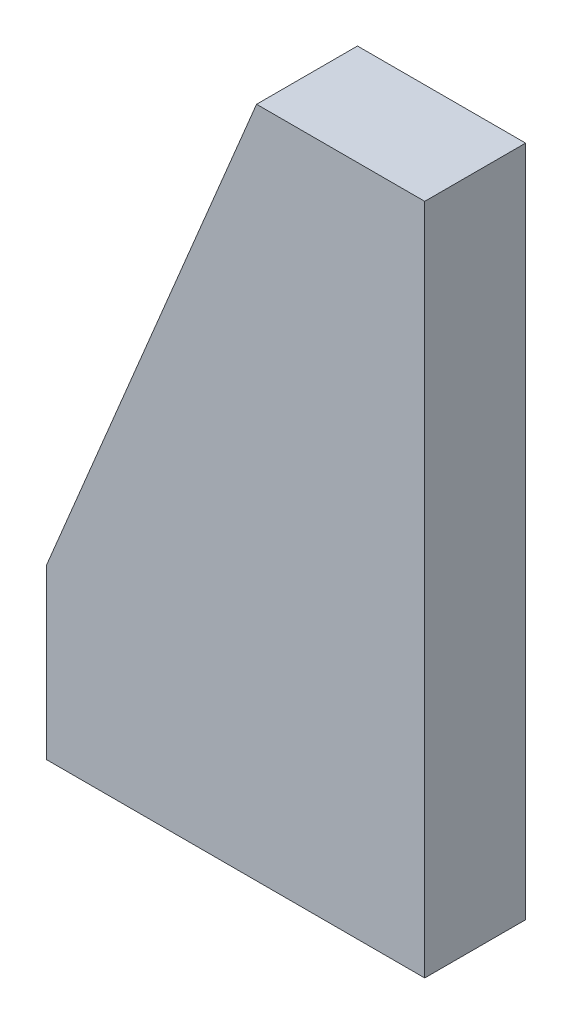
ISO-10303-21;
HEADER;
FILE_DESCRIPTION(('STEP AP214'),'2;1');
FILE_NAME('part.step','',(''),(''),'','','');
FILE_SCHEMA(('AUTOMOTIVE_DESIGN { 1 0 10303 214 1 1 1 1 }'));
ENDSEC;
DATA;
#1=APPLICATION_CONTEXT('core data for automotive mechanical design processes');
#2=APPLICATION_PROTOCOL_DEFINITION('international standard','automotive_design',2000,#1);
#3=PRODUCT_CONTEXT('',#1,'mechanical');
#4=PRODUCT('Part','Part','',(#3));
#5=PRODUCT_RELATED_PRODUCT_CATEGORY('part','',(#4));
#6=PRODUCT_DEFINITION_FORMATION('','',#4);
#7=PRODUCT_DEFINITION_CONTEXT('part definition',#1,'design');
#8=PRODUCT_DEFINITION('design','',#6,#7);
#9=PRODUCT_DEFINITION_SHAPE('','',#8);
#10=(LENGTH_UNIT() NAMED_UNIT(*) SI_UNIT(.MILLI.,.METRE.));
#11=(NAMED_UNIT(*) PLANE_ANGLE_UNIT() SI_UNIT($,.RADIAN.));
#12=(NAMED_UNIT(*) SI_UNIT($,.STERADIAN.) SOLID_ANGLE_UNIT());
#13=UNCERTAINTY_MEASURE_WITH_UNIT(LENGTH_MEASURE(1.E-05),#10,'distance_accuracy_value','');
#14=(GEOMETRIC_REPRESENTATION_CONTEXT(3) GLOBAL_UNCERTAINTY_ASSIGNED_CONTEXT((#13)) GLOBAL_UNIT_ASSIGNED_CONTEXT((#10,
#11,#12)) REPRESENTATION_CONTEXT('',''));
#15=CARTESIAN_POINT('',(0.,0.,0.));
#16=DIRECTION('',(0.,0.,1.));
#17=DIRECTION('',(1.,0.,0.));
#18=AXIS2_PLACEMENT_3D('',#15,#16,#17);
#19=CARTESIAN_POINT('',(0.,20.,12.));
#20=DIRECTION('',(1.,0.,0.));
#21=DIRECTION('',(0.,1.,0.));
#22=AXIS2_PLACEMENT_3D('',#19,#20,#21);
#23=PLANE('',#22);
#24=DIRECTION('',(0.,-1.,0.));
#25=VECTOR('',#24,1.);
#26=CARTESIAN_POINT('',(0.,20.,0.));
#27=LINE('',#26,#25);
#28=CARTESIAN_POINT('',(0.,20.,0.));
#29=VERTEX_POINT('',#28);
#30=CARTESIAN_POINT('',(0.,0.,0.));
#31=VERTEX_POINT('',#30);
#32=EDGE_CURVE('E108',#29,#31,#27,.T.);
#33=ORIENTED_EDGE('',*,*,#32,.T.);
#34=DIRECTION('',(0.,0.,-1.));
#35=VECTOR('',#34,1.);
#36=CARTESIAN_POINT('',(0.,0.,12.));
#37=LINE('',#36,#35);
#38=CARTESIAN_POINT('',(0.,0.,12.));
#39=VERTEX_POINT('',#38);
#40=EDGE_CURVE('E11',#39,#31,#37,.T.);
#41=ORIENTED_EDGE('',*,*,#40,.F.);
#42=DIRECTION('',(0.,-1.,0.));
#43=VECTOR('',#42,1.);
#44=CARTESIAN_POINT('',(0.,20.,12.));
#45=LINE('',#44,#43);
#46=CARTESIAN_POINT('',(0.,20.,12.));
#47=VERTEX_POINT('',#46);
#48=EDGE_CURVE('E116',#47,#39,#45,.T.);
#49=ORIENTED_EDGE('',*,*,#48,.F.);
#50=DIRECTION('',(0.,0.,-1.));
#51=VECTOR('',#50,1.);
#52=CARTESIAN_POINT('',(0.,20.,12.));
#53=LINE('',#52,#51);
#54=EDGE_CURVE('E104',#47,#29,#53,.T.);
#55=ORIENTED_EDGE('',*,*,#54,.T.);
#56=EDGE_LOOP('',(#33,#41,#49,#55));
#57=FACE_BOUND('',#56,.T.);
#58=ADVANCED_FACE('F34',(#57),#23,.F.);
#59=CARTESIAN_POINT('',(0.,0.,12.));
#60=DIRECTION('',(0.,1.,0.));
#61=DIRECTION('',(0.,0.,1.));
#62=AXIS2_PLACEMENT_3D('',#59,#60,#61);
#63=PLANE('',#62);
#64=DIRECTION('',(1.,0.,0.));
#65=VECTOR('',#64,1.);
#66=CARTESIAN_POINT('',(0.,0.,0.));
#67=LINE('',#66,#65);
#68=CARTESIAN_POINT('',(45.,0.,0.));
#69=VERTEX_POINT('',#68);
#70=EDGE_CURVE('E111',#31,#69,#67,.T.);
#71=ORIENTED_EDGE('',*,*,#70,.T.);
#72=DIRECTION('',(0.,0.,-1.));
#73=VECTOR('',#72,1.);
#74=CARTESIAN_POINT('',(45.,0.,12.));
#75=LINE('',#74,#73);
#76=CARTESIAN_POINT('',(45.,0.,12.));
#77=VERTEX_POINT('',#76);
#78=EDGE_CURVE('E42',#77,#69,#75,.T.);
#79=ORIENTED_EDGE('',*,*,#78,.F.);
#80=DIRECTION('',(1.,0.,0.));
#81=VECTOR('',#80,1.);
#82=CARTESIAN_POINT('',(0.,0.,12.));
#83=LINE('',#82,#81);
#84=EDGE_CURVE('E84',#39,#77,#83,.T.);
#85=ORIENTED_EDGE('',*,*,#84,.F.);
#86=ORIENTED_EDGE('',*,*,#40,.T.);
#87=EDGE_LOOP('',(#71,#79,#85,#86));
#88=FACE_BOUND('',#87,.T.);
#89=ADVANCED_FACE('F135',(#88),#63,.F.);
#90=CARTESIAN_POINT('',(45.,0.,12.));
#91=DIRECTION('',(-1.,0.,0.));
#92=DIRECTION('',(0.,0.,1.));
#93=AXIS2_PLACEMENT_3D('',#90,#91,#92);
#94=PLANE('',#93);
#95=DIRECTION('',(0.,1.,0.));
#96=VECTOR('',#95,1.);
#97=CARTESIAN_POINT('',(45.,0.,0.));
#98=LINE('',#97,#96);
#99=CARTESIAN_POINT('',(45.,80.,0.));
#100=VERTEX_POINT('',#99);
#101=EDGE_CURVE('E99',#69,#100,#98,.T.);
#102=ORIENTED_EDGE('',*,*,#101,.T.);
#103=DIRECTION('',(0.,0.,-1.));
#104=VECTOR('',#103,1.);
#105=CARTESIAN_POINT('',(45.,80.,12.));
#106=LINE('',#105,#104);
#107=CARTESIAN_POINT('',(45.,80.,12.));
#108=VERTEX_POINT('',#107);
#109=EDGE_CURVE('E96',#108,#100,#106,.T.);
#110=ORIENTED_EDGE('',*,*,#109,.F.);
#111=DIRECTION('',(0.,1.,0.));
#112=VECTOR('',#111,1.);
#113=CARTESIAN_POINT('',(45.,0.,12.));
#114=LINE('',#113,#112);
#115=EDGE_CURVE('E88',#77,#108,#114,.T.);
#116=ORIENTED_EDGE('',*,*,#115,.F.);
#117=ORIENTED_EDGE('',*,*,#78,.T.);
#118=EDGE_LOOP('',(#102,#110,#116,#117));
#119=FACE_BOUND('',#118,.T.);
#120=ADVANCED_FACE('F97',(#119),#94,.F.);
#121=CARTESIAN_POINT('',(45.,80.,12.));
#122=DIRECTION('',(0.,-1.,0.));
#123=DIRECTION('',(0.,0.,-1.));
#124=AXIS2_PLACEMENT_3D('',#121,#122,#123);
#125=PLANE('',#124);
#126=DIRECTION('',(-1.,0.,0.));
#127=VECTOR('',#126,1.);
#128=CARTESIAN_POINT('',(45.,80.,0.));
#129=LINE('',#128,#127);
#130=CARTESIAN_POINT('',(25.,80.,0.));
#131=VERTEX_POINT('',#130);
#132=EDGE_CURVE('E70',#100,#131,#129,.T.);
#133=ORIENTED_EDGE('',*,*,#132,.T.);
#134=DIRECTION('',(0.,0.,-1.));
#135=VECTOR('',#134,1.);
#136=CARTESIAN_POINT('',(25.,80.,12.));
#137=LINE('',#136,#135);
#138=CARTESIAN_POINT('',(25.,80.,12.));
#139=VERTEX_POINT('',#138);
#140=EDGE_CURVE('E100',#139,#131,#137,.T.);
#141=ORIENTED_EDGE('',*,*,#140,.F.);
#142=DIRECTION('',(-1.,0.,0.));
#143=VECTOR('',#142,1.);
#144=CARTESIAN_POINT('',(45.,80.,12.));
#145=LINE('',#144,#143);
#146=EDGE_CURVE('E92',#108,#139,#145,.T.);
#147=ORIENTED_EDGE('',*,*,#146,.F.);
#148=ORIENTED_EDGE('',*,*,#109,.T.);
#149=EDGE_LOOP('',(#133,#141,#147,#148));
#150=FACE_BOUND('',#149,.T.);
#151=ADVANCED_FACE('F102',(#150),#125,.F.);
#152=CARTESIAN_POINT('',(25.,80.,12.));
#153=DIRECTION('',(0.923076923076923,-0.384615384615385,0.));
#154=DIRECTION('',(0.384615384615385,0.923076923076923,0.));
#155=AXIS2_PLACEMENT_3D('',#152,#153,#154);
#156=PLANE('',#155);
#157=DIRECTION('',(-0.384615384615385,-0.923076923076923,0.));
#158=VECTOR('',#157,1.);
#159=CARTESIAN_POINT('',(25.,80.,0.));
#160=LINE('',#159,#158);
#161=EDGE_CURVE('E76',#131,#29,#160,.T.);
#162=ORIENTED_EDGE('',*,*,#161,.T.);
#163=ORIENTED_EDGE('',*,*,#54,.F.);
#164=DIRECTION('',(-0.384615384615385,-0.923076923076923,0.));
#165=VECTOR('',#164,1.);
#166=CARTESIAN_POINT('',(25.,80.,12.));
#167=LINE('',#166,#165);
#168=EDGE_CURVE('E50',#139,#47,#167,.T.);
#169=ORIENTED_EDGE('',*,*,#168,.F.);
#170=ORIENTED_EDGE('',*,*,#140,.T.);
#171=EDGE_LOOP('',(#162,#163,#169,#170));
#172=FACE_BOUND('',#171,.T.);
#173=ADVANCED_FACE('F124',(#172),#156,.F.);
#174=CARTESIAN_POINT('',(0.,0.,12.));
#175=DIRECTION('',(0.,0.,1.));
#176=DIRECTION('',(1.,0.,0.));
#177=AXIS2_PLACEMENT_3D('',#174,#175,#176);
#178=PLANE('',#177);
#179=ORIENTED_EDGE('',*,*,#48,.T.);
#180=ORIENTED_EDGE('',*,*,#84,.T.);
#181=ORIENTED_EDGE('',*,*,#115,.T.);
#182=ORIENTED_EDGE('',*,*,#146,.T.);
#183=ORIENTED_EDGE('',*,*,#168,.T.);
#184=EDGE_LOOP('',(#179,#180,#181,#182,#183));
#185=FACE_BOUND('',#184,.T.);
#186=ADVANCED_FACE('F90',(#185),#178,.T.);
#187=CARTESIAN_POINT('',(0.,0.,0.));
#188=DIRECTION('',(0.,0.,1.));
#189=DIRECTION('',(1.,0.,0.));
#190=AXIS2_PLACEMENT_3D('',#187,#188,#189);
#191=PLANE('',#190);
#192=ORIENTED_EDGE('',*,*,#32,.F.);
#193=ORIENTED_EDGE('',*,*,#161,.F.);
#194=ORIENTED_EDGE('',*,*,#132,.F.);
#195=ORIENTED_EDGE('',*,*,#101,.F.);
#196=ORIENTED_EDGE('',*,*,#70,.F.);
#197=EDGE_LOOP('',(#192,#193,#194,#195,#196));
#198=FACE_BOUND('',#197,.T.);
#199=ADVANCED_FACE('F120',(#198),#191,.F.);
#200=CLOSED_SHELL('',(#58,#89,#120,#151,#173,#186,#199));
#201=MANIFOLD_SOLID_BREP('B2',#200);
#202=ADVANCED_BREP_SHAPE_REPRESENTATION('',(#18,#201),#14);
#203=SHAPE_DEFINITION_REPRESENTATION(#9,#202);
ENDSEC;
END-ISO-10303-21;
